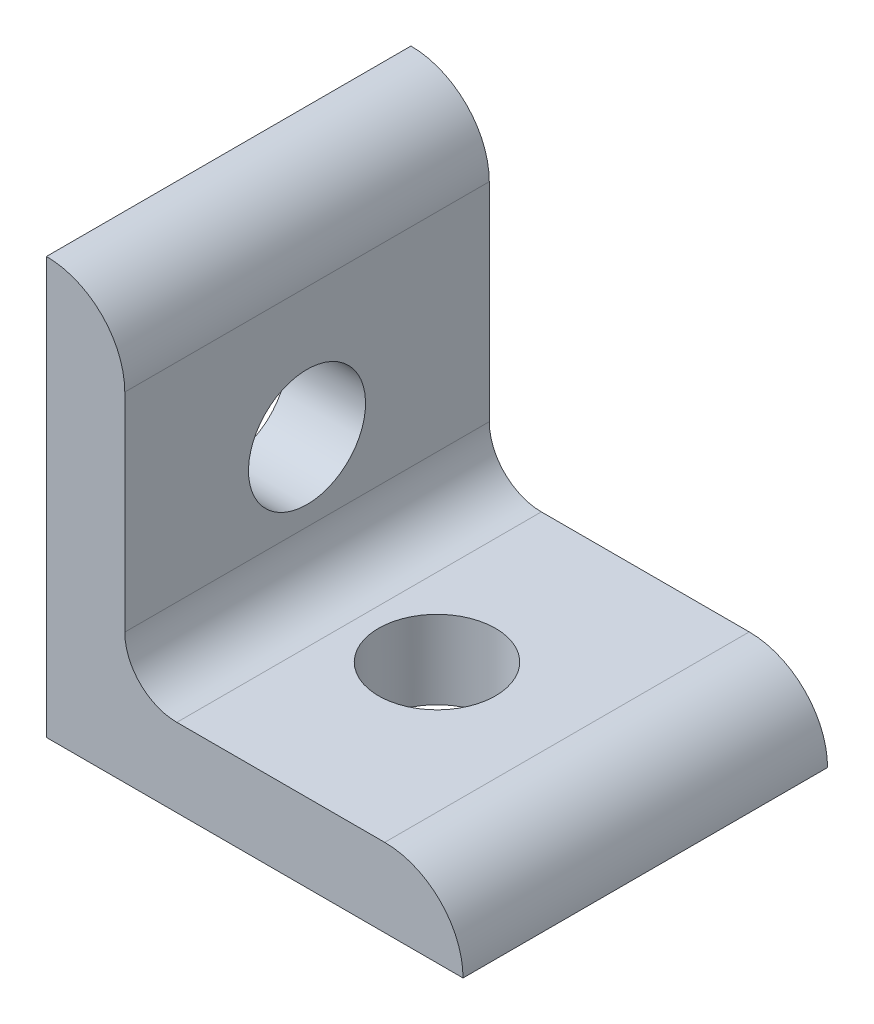
ISO-10303-21;
HEADER;
FILE_DESCRIPTION(('STEP AP214'),'2;1');
FILE_NAME('part.step','',(''),(''),'','','');
FILE_SCHEMA(('AUTOMOTIVE_DESIGN { 1 0 10303 214 1 1 1 1 }'));
ENDSEC;
DATA;
#1=APPLICATION_CONTEXT('core data for automotive mechanical design processes');
#2=APPLICATION_PROTOCOL_DEFINITION('international standard','automotive_design',2000,#1);
#3=PRODUCT_CONTEXT('',#1,'mechanical');
#4=PRODUCT('Part','Part','',(#3));
#5=PRODUCT_RELATED_PRODUCT_CATEGORY('part','',(#4));
#6=PRODUCT_DEFINITION_FORMATION('','',#4);
#7=PRODUCT_DEFINITION_CONTEXT('part definition',#1,'design');
#8=PRODUCT_DEFINITION('design','',#6,#7);
#9=PRODUCT_DEFINITION_SHAPE('','',#8);
#10=(LENGTH_UNIT() NAMED_UNIT(*) SI_UNIT(.MILLI.,.METRE.));
#11=(NAMED_UNIT(*) PLANE_ANGLE_UNIT() SI_UNIT($,.RADIAN.));
#12=(NAMED_UNIT(*) SI_UNIT($,.STERADIAN.) SOLID_ANGLE_UNIT());
#13=UNCERTAINTY_MEASURE_WITH_UNIT(LENGTH_MEASURE(1.E-05),#10,'distance_accuracy_value','');
#14=(GEOMETRIC_REPRESENTATION_CONTEXT(3) GLOBAL_UNCERTAINTY_ASSIGNED_CONTEXT((#13)) GLOBAL_UNIT_ASSIGNED_CONTEXT((#10,
#11,#12)) REPRESENTATION_CONTEXT('',''));
#15=CARTESIAN_POINT('',(0.,0.,0.));
#16=DIRECTION('',(0.,0.,1.));
#17=DIRECTION('',(1.,0.,0.));
#18=AXIS2_PLACEMENT_3D('',#15,#16,#17);
#19=CARTESIAN_POINT('',(4.7752,20.6248,11.1125));
#20=DIRECTION('',(-1.,0.,0.));
#21=DIRECTION('',(0.,-1.,0.));
#22=AXIS2_PLACEMENT_3D('',#19,#20,#21);
#23=PLANE('',#22);
#24=DIRECTION('',(0.,1.,0.));
#25=VECTOR('',#24,1.);
#26=CARTESIAN_POINT('',(4.7752,20.6248,-11.1125));
#27=LINE('',#26,#25);
#28=CARTESIAN_POINT('',(4.7752,7.9502,-11.1125));
#29=VERTEX_POINT('',#28);
#30=CARTESIAN_POINT('',(4.7752,20.6248,-11.1125));
#31=VERTEX_POINT('',#30);
#32=EDGE_CURVE('E112',#29,#31,#27,.T.);
#33=ORIENTED_EDGE('',*,*,#32,.T.);
#34=DIRECTION('',(0.,0.,-1.));
#35=VECTOR('',#34,1.);
#36=CARTESIAN_POINT('',(4.7752,20.6248,11.1125));
#37=LINE('',#36,#35);
#38=CARTESIAN_POINT('',(4.7752,20.6248,11.1125));
#39=VERTEX_POINT('',#38);
#40=EDGE_CURVE('E109',#39,#31,#37,.T.);
#41=ORIENTED_EDGE('',*,*,#40,.F.);
#42=DIRECTION('',(0.,1.,0.));
#43=VECTOR('',#42,1.);
#44=CARTESIAN_POINT('',(4.7752,20.6248,11.1125));
#45=LINE('',#44,#43);
#46=CARTESIAN_POINT('',(4.7752,7.9502,11.1125));
#47=VERTEX_POINT('',#46);
#48=EDGE_CURVE('E98',#47,#39,#45,.T.);
#49=ORIENTED_EDGE('',*,*,#48,.F.);
#50=DIRECTION('',(0.,0.,-1.));
#51=VECTOR('',#50,1.);
#52=CARTESIAN_POINT('',(4.7752,7.9502,11.1125));
#53=LINE('',#52,#51);
#54=EDGE_CURVE('E113',#47,#29,#53,.T.);
#55=ORIENTED_EDGE('',*,*,#54,.T.);
#56=EDGE_LOOP('',(#33,#41,#49,#55));
#57=FACE_BOUND('',#56,.T.);
#58=CARTESIAN_POINT('',(4.7752,12.7,0.));
#59=DIRECTION('',(-1.,0.,0.));
#60=DIRECTION('',(0.,-1.,0.));
#61=AXIS2_PLACEMENT_3D('',#58,#59,#60);
#62=CIRCLE('',#61,3.5687);
#63=CARTESIAN_POINT('',(4.7752,9.1313,0.));
#64=VERTEX_POINT('',#63);
#65=EDGE_CURVE('E162',#64,#64,#62,.F.);
#66=ORIENTED_EDGE('',*,*,#65,.F.);
#67=EDGE_LOOP('',(#66));
#68=FACE_BOUND('',#67,.T.);
#69=ADVANCED_FACE('F30',(#57,#68),#23,.F.);
#70=CARTESIAN_POINT('',(0.,0.,11.1125));
#71=DIRECTION('',(1.,0.,0.));
#72=DIRECTION('',(0.,0.,-1.));
#73=AXIS2_PLACEMENT_3D('',#70,#71,#72);
#74=PLANE('',#73);
#75=DIRECTION('',(0.,-1.,0.));
#76=VECTOR('',#75,1.);
#77=CARTESIAN_POINT('',(0.,0.,-11.1125));
#78=LINE('',#77,#76);
#79=CARTESIAN_POINT('',(0.,25.4,-11.1125));
#80=VERTEX_POINT('',#79);
#81=CARTESIAN_POINT('',(0.,0.,-11.1125));
#82=VERTEX_POINT('',#81);
#83=EDGE_CURVE('E80',#80,#82,#78,.T.);
#84=ORIENTED_EDGE('',*,*,#83,.T.);
#85=DIRECTION('',(0.,0.,-1.));
#86=VECTOR('',#85,1.);
#87=CARTESIAN_POINT('',(0.,0.,11.1125));
#88=LINE('',#87,#86);
#89=CARTESIAN_POINT('',(0.,0.,11.1125));
#90=VERTEX_POINT('',#89);
#91=EDGE_CURVE('E118',#90,#82,#88,.T.);
#92=ORIENTED_EDGE('',*,*,#91,.F.);
#93=DIRECTION('',(0.,-1.,0.));
#94=VECTOR('',#93,1.);
#95=CARTESIAN_POINT('',(0.,0.,11.1125));
#96=LINE('',#95,#94);
#97=CARTESIAN_POINT('',(0.,25.4,11.1125));
#98=VERTEX_POINT('',#97);
#99=EDGE_CURVE('E48',#98,#90,#96,.T.);
#100=ORIENTED_EDGE('',*,*,#99,.F.);
#101=DIRECTION('',(0.,0.,-1.));
#102=VECTOR('',#101,1.);
#103=CARTESIAN_POINT('',(0.,25.4,11.1125));
#104=LINE('',#103,#102);
#105=EDGE_CURVE('E114',#98,#80,#104,.T.);
#106=ORIENTED_EDGE('',*,*,#105,.T.);
#107=EDGE_LOOP('',(#84,#92,#100,#106));
#108=FACE_BOUND('',#107,.T.);
#109=CARTESIAN_POINT('',(0.,12.7,0.));
#110=DIRECTION('',(1.,0.,0.));
#111=DIRECTION('',(0.,0.,-1.));
#112=AXIS2_PLACEMENT_3D('',#109,#110,#111);
#113=CIRCLE('',#112,3.5687);
#114=CARTESIAN_POINT('',(0.,12.7,-3.5687));
#115=VERTEX_POINT('',#114);
#116=EDGE_CURVE('E165',#115,#115,#113,.T.);
#117=ORIENTED_EDGE('',*,*,#116,.T.);
#118=EDGE_LOOP('',(#117));
#119=FACE_BOUND('',#118,.T.);
#120=ADVANCED_FACE('F169',(#108,#119),#74,.F.);
#121=CARTESIAN_POINT('',(25.4,0.,11.1125));
#122=DIRECTION('',(0.,1.,0.));
#123=DIRECTION('',(-1.,0.,0.));
#124=AXIS2_PLACEMENT_3D('',#121,#122,#123);
#125=PLANE('',#124);
#126=DIRECTION('',(1.,0.,0.));
#127=VECTOR('',#126,1.);
#128=CARTESIAN_POINT('',(25.4,0.,-11.1125));
#129=LINE('',#128,#127);
#130=CARTESIAN_POINT('',(25.4,0.,-11.1125));
#131=VERTEX_POINT('',#130);
#132=EDGE_CURVE('E122',#82,#131,#129,.T.);
#133=ORIENTED_EDGE('',*,*,#132,.T.);
#134=DIRECTION('',(0.,0.,-1.));
#135=VECTOR('',#134,1.);
#136=CARTESIAN_POINT('',(25.4,0.,11.1125));
#137=LINE('',#136,#135);
#138=CARTESIAN_POINT('',(25.4,0.,11.1125));
#139=VERTEX_POINT('',#138);
#140=EDGE_CURVE('E11',#139,#131,#137,.T.);
#141=ORIENTED_EDGE('',*,*,#140,.F.);
#142=DIRECTION('',(1.,0.,0.));
#143=VECTOR('',#142,1.);
#144=CARTESIAN_POINT('',(25.4,0.,11.1125));
#145=LINE('',#144,#143);
#146=EDGE_CURVE('E134',#90,#139,#145,.T.);
#147=ORIENTED_EDGE('',*,*,#146,.F.);
#148=ORIENTED_EDGE('',*,*,#91,.T.);
#149=EDGE_LOOP('',(#133,#141,#147,#148));
#150=FACE_BOUND('',#149,.T.);
#151=CARTESIAN_POINT('',(12.7,0.,0.));
#152=DIRECTION('',(0.,1.,0.));
#153=DIRECTION('',(0.,0.,1.));
#154=AXIS2_PLACEMENT_3D('',#151,#152,#153);
#155=CIRCLE('',#154,3.5687);
#156=CARTESIAN_POINT('',(12.7,0.,3.5687));
#157=VERTEX_POINT('',#156);
#158=EDGE_CURVE('E159',#157,#157,#155,.T.);
#159=ORIENTED_EDGE('',*,*,#158,.T.);
#160=EDGE_LOOP('',(#159));
#161=FACE_BOUND('',#160,.T.);
#162=ADVANCED_FACE('F32',(#150,#161),#125,.F.);
#163=CARTESIAN_POINT('',(7.9502,4.7752,11.1125));
#164=DIRECTION('',(0.,-1.,0.));
#165=DIRECTION('',(0.,0.,-1.));
#166=AXIS2_PLACEMENT_3D('',#163,#164,#165);
#167=PLANE('',#166);
#168=DIRECTION('',(-1.,0.,0.));
#169=VECTOR('',#168,1.);
#170=CARTESIAN_POINT('',(7.9502,4.7752,-11.1125));
#171=LINE('',#170,#169);
#172=CARTESIAN_POINT('',(20.6248,4.7752,-11.1125));
#173=VERTEX_POINT('',#172);
#174=CARTESIAN_POINT('',(7.9502,4.7752,-11.1125));
#175=VERTEX_POINT('',#174);
#176=EDGE_CURVE('E127',#173,#175,#171,.T.);
#177=ORIENTED_EDGE('',*,*,#176,.T.);
#178=DIRECTION('',(0.,0.,-1.));
#179=VECTOR('',#178,1.);
#180=CARTESIAN_POINT('',(7.9502,4.7752,11.1125));
#181=LINE('',#180,#179);
#182=CARTESIAN_POINT('',(7.9502,4.7752,11.1125));
#183=VERTEX_POINT('',#182);
#184=EDGE_CURVE('E138',#183,#175,#181,.T.);
#185=ORIENTED_EDGE('',*,*,#184,.F.);
#186=DIRECTION('',(-1.,0.,0.));
#187=VECTOR('',#186,1.);
#188=CARTESIAN_POINT('',(7.9502,4.7752,11.1125));
#189=LINE('',#188,#187);
#190=CARTESIAN_POINT('',(20.6248,4.7752,11.1125));
#191=VERTEX_POINT('',#190);
#192=EDGE_CURVE('E148',#191,#183,#189,.T.);
#193=ORIENTED_EDGE('',*,*,#192,.F.);
#194=DIRECTION('',(0.,0.,-1.));
#195=VECTOR('',#194,1.);
#196=CARTESIAN_POINT('',(20.6248,4.7752,11.1125));
#197=LINE('',#196,#195);
#198=EDGE_CURVE('E40',#191,#173,#197,.T.);
#199=ORIENTED_EDGE('',*,*,#198,.T.);
#200=EDGE_LOOP('',(#177,#185,#193,#199));
#201=FACE_BOUND('',#200,.T.);
#202=CARTESIAN_POINT('',(12.7,4.7752,0.));
#203=DIRECTION('',(0.,-1.,0.));
#204=DIRECTION('',(0.,0.,-1.));
#205=AXIS2_PLACEMENT_3D('',#202,#203,#204);
#206=CIRCLE('',#205,3.5687);
#207=CARTESIAN_POINT('',(12.7,4.7752,-3.5687));
#208=VERTEX_POINT('',#207);
#209=EDGE_CURVE('E34',#208,#208,#206,.F.);
#210=ORIENTED_EDGE('',*,*,#209,.F.);
#211=EDGE_LOOP('',(#210));
#212=FACE_BOUND('',#211,.T.);
#213=ADVANCED_FACE('F145',(#201,#212),#167,.F.);
#214=CARTESIAN_POINT('',(20.6248,0.,11.1125));
#215=DIRECTION('',(0.,0.,-1.));
#216=DIRECTION('',(-1.,0.,0.));
#217=AXIS2_PLACEMENT_3D('',#214,#215,#216);
#218=CYLINDRICAL_SURFACE('',#217,4.7752);
#219=CARTESIAN_POINT('',(20.6248,0.,-11.1125));
#220=DIRECTION('',(0.,0.,1.));
#221=DIRECTION('',(1.,0.,0.));
#222=AXIS2_PLACEMENT_3D('',#219,#220,#221);
#223=CIRCLE('',#222,4.7752);
#224=EDGE_CURVE('E125',#131,#173,#223,.T.);
#225=ORIENTED_EDGE('',*,*,#224,.T.);
#226=ORIENTED_EDGE('',*,*,#198,.F.);
#227=CARTESIAN_POINT('',(20.6248,0.,11.1125));
#228=DIRECTION('',(0.,0.,1.));
#229=DIRECTION('',(1.,0.,0.));
#230=AXIS2_PLACEMENT_3D('',#227,#228,#229);
#231=CIRCLE('',#230,4.7752);
#232=EDGE_CURVE('E88',#139,#191,#231,.T.);
#233=ORIENTED_EDGE('',*,*,#232,.F.);
#234=ORIENTED_EDGE('',*,*,#140,.T.);
#235=EDGE_LOOP('',(#225,#226,#233,#234));
#236=FACE_BOUND('',#235,.T.);
#237=ADVANCED_FACE('F187',(#236),#218,.T.);
#238=CARTESIAN_POINT('',(7.9502,7.9502,11.1125));
#239=DIRECTION('',(0.,0.,-1.));
#240=DIRECTION('',(-1.,0.,0.));
#241=AXIS2_PLACEMENT_3D('',#238,#239,#240);
#242=CYLINDRICAL_SURFACE('',#241,3.175);
#243=CARTESIAN_POINT('',(7.9502,7.9502,-11.1125));
#244=DIRECTION('',(0.,0.,-1.));
#245=DIRECTION('',(1.,0.,0.));
#246=AXIS2_PLACEMENT_3D('',#243,#244,#245);
#247=CIRCLE('',#246,3.175);
#248=EDGE_CURVE('E129',#175,#29,#247,.T.);
#249=ORIENTED_EDGE('',*,*,#248,.T.);
#250=ORIENTED_EDGE('',*,*,#54,.F.);
#251=CARTESIAN_POINT('',(7.9502,7.9502,11.1125));
#252=DIRECTION('',(0.,0.,-1.));
#253=DIRECTION('',(1.,0.,0.));
#254=AXIS2_PLACEMENT_3D('',#251,#252,#253);
#255=CIRCLE('',#254,3.175);
#256=EDGE_CURVE('E104',#183,#47,#255,.T.);
#257=ORIENTED_EDGE('',*,*,#256,.F.);
#258=ORIENTED_EDGE('',*,*,#184,.T.);
#259=EDGE_LOOP('',(#249,#250,#257,#258));
#260=FACE_BOUND('',#259,.T.);
#261=ADVANCED_FACE('F154',(#260),#242,.F.);
#262=CARTESIAN_POINT('',(0.,20.6248,11.1125));
#263=DIRECTION('',(0.,0.,-1.));
#264=DIRECTION('',(-1.,0.,0.));
#265=AXIS2_PLACEMENT_3D('',#262,#263,#264);
#266=CYLINDRICAL_SURFACE('',#265,4.7752);
#267=CARTESIAN_POINT('',(0.,20.6248,-11.1125));
#268=DIRECTION('',(0.,0.,1.));
#269=DIRECTION('',(1.,0.,0.));
#270=AXIS2_PLACEMENT_3D('',#267,#268,#269);
#271=CIRCLE('',#270,4.7752);
#272=EDGE_CURVE('E74',#31,#80,#271,.T.);
#273=ORIENTED_EDGE('',*,*,#272,.T.);
#274=ORIENTED_EDGE('',*,*,#105,.F.);
#275=CARTESIAN_POINT('',(0.,20.6248,11.1125));
#276=DIRECTION('',(0.,0.,1.));
#277=DIRECTION('',(1.,0.,0.));
#278=AXIS2_PLACEMENT_3D('',#275,#276,#277);
#279=CIRCLE('',#278,4.7752);
#280=EDGE_CURVE('E102',#39,#98,#279,.T.);
#281=ORIENTED_EDGE('',*,*,#280,.F.);
#282=ORIENTED_EDGE('',*,*,#40,.T.);
#283=EDGE_LOOP('',(#273,#274,#281,#282));
#284=FACE_BOUND('',#283,.T.);
#285=ADVANCED_FACE('F116',(#284),#266,.T.);
#286=CARTESIAN_POINT('',(0.,20.6248,11.1125));
#287=DIRECTION('',(0.,0.,1.));
#288=DIRECTION('',(1.,0.,0.));
#289=AXIS2_PLACEMENT_3D('',#286,#287,#288);
#290=PLANE('',#289);
#291=ORIENTED_EDGE('',*,*,#146,.T.);
#292=ORIENTED_EDGE('',*,*,#232,.T.);
#293=ORIENTED_EDGE('',*,*,#192,.T.);
#294=ORIENTED_EDGE('',*,*,#256,.T.);
#295=ORIENTED_EDGE('',*,*,#48,.T.);
#296=ORIENTED_EDGE('',*,*,#280,.T.);
#297=ORIENTED_EDGE('',*,*,#99,.T.);
#298=EDGE_LOOP('',(#291,#292,#293,#294,#295,#296,#297));
#299=FACE_BOUND('',#298,.T.);
#300=ADVANCED_FACE('F100',(#299),#290,.T.);
#301=CARTESIAN_POINT('',(0.,20.6248,-11.1125));
#302=DIRECTION('',(0.,0.,1.));
#303=DIRECTION('',(1.,0.,0.));
#304=AXIS2_PLACEMENT_3D('',#301,#302,#303);
#305=PLANE('',#304);
#306=ORIENTED_EDGE('',*,*,#132,.F.);
#307=ORIENTED_EDGE('',*,*,#83,.F.);
#308=ORIENTED_EDGE('',*,*,#272,.F.);
#309=ORIENTED_EDGE('',*,*,#32,.F.);
#310=ORIENTED_EDGE('',*,*,#248,.F.);
#311=ORIENTED_EDGE('',*,*,#176,.F.);
#312=ORIENTED_EDGE('',*,*,#224,.F.);
#313=EDGE_LOOP('',(#306,#307,#308,#309,#310,#311,#312));
#314=FACE_BOUND('',#313,.T.);
#315=ADVANCED_FACE('F152',(#314),#305,.F.);
#316=CARTESIAN_POINT('',(12.7,25.4,0.));
#317=DIRECTION('',(0.,-1.,0.));
#318=DIRECTION('',(0.,0.,-1.));
#319=AXIS2_PLACEMENT_3D('',#316,#317,#318);
#320=CYLINDRICAL_SURFACE('',#319,3.5687);
#321=ORIENTED_EDGE('',*,*,#158,.F.);
#322=EDGE_LOOP('',(#321));
#323=FACE_BOUND('',#322,.T.);
#324=ORIENTED_EDGE('',*,*,#209,.T.);
#325=EDGE_LOOP('',(#324));
#326=FACE_BOUND('',#325,.T.);
#327=ADVANCED_FACE('F174',(#323,#326),#320,.F.);
#328=CARTESIAN_POINT('',(25.4,12.7,0.));
#329=DIRECTION('',(-1.,0.,0.));
#330=DIRECTION('',(0.,0.,1.));
#331=AXIS2_PLACEMENT_3D('',#328,#329,#330);
#332=CYLINDRICAL_SURFACE('',#331,3.5687);
#333=ORIENTED_EDGE('',*,*,#116,.F.);
#334=EDGE_LOOP('',(#333));
#335=FACE_BOUND('',#334,.T.);
#336=ORIENTED_EDGE('',*,*,#65,.T.);
#337=EDGE_LOOP('',(#336));
#338=FACE_BOUND('',#337,.T.);
#339=ADVANCED_FACE('F171',(#335,#338),#332,.F.);
#340=CLOSED_SHELL('',(#69,#120,#162,#213,#237,#261,#285,#300,#315,#327,#339));
#341=MANIFOLD_SOLID_BREP('B2',#340);
#342=ADVANCED_BREP_SHAPE_REPRESENTATION('',(#18,#341),#14);
#343=SHAPE_DEFINITION_REPRESENTATION(#9,#342);
ENDSEC;
END-ISO-10303-21;
